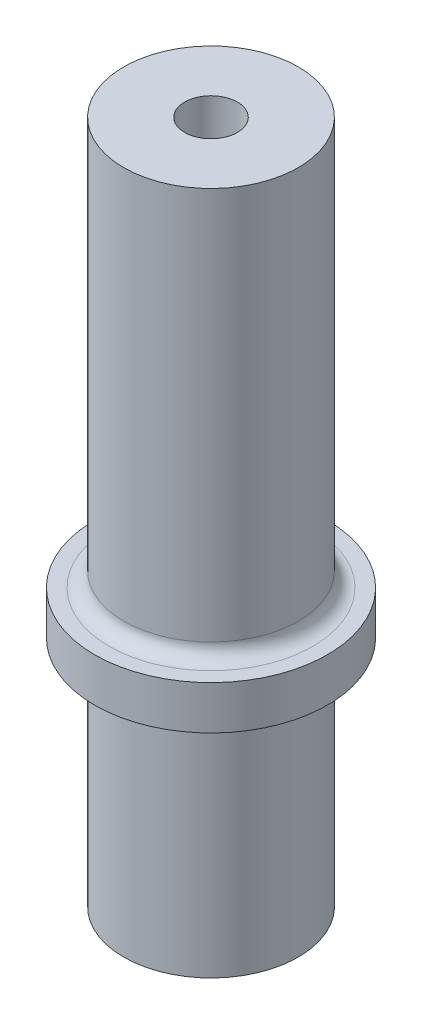
ISO-10303-21;
HEADER;
FILE_DESCRIPTION(('STEP AP214'),'2;1');
FILE_NAME('part.step','',(''),(''),'','','');
FILE_SCHEMA(('AUTOMOTIVE_DESIGN { 1 0 10303 214 1 1 1 1 }'));
ENDSEC;
DATA;
#1=APPLICATION_CONTEXT('core data for automotive mechanical design processes');
#2=APPLICATION_PROTOCOL_DEFINITION('international standard','automotive_design',2000,#1);
#3=PRODUCT_CONTEXT('',#1,'mechanical');
#4=PRODUCT('Part','Part','',(#3));
#5=PRODUCT_RELATED_PRODUCT_CATEGORY('part','',(#4));
#6=PRODUCT_DEFINITION_FORMATION('','',#4);
#7=PRODUCT_DEFINITION_CONTEXT('part definition',#1,'design');
#8=PRODUCT_DEFINITION('design','',#6,#7);
#9=PRODUCT_DEFINITION_SHAPE('','',#8);
#10=(LENGTH_UNIT() NAMED_UNIT(*) SI_UNIT(.MILLI.,.METRE.));
#11=(NAMED_UNIT(*) PLANE_ANGLE_UNIT() SI_UNIT($,.RADIAN.));
#12=(NAMED_UNIT(*) SI_UNIT($,.STERADIAN.) SOLID_ANGLE_UNIT());
#13=UNCERTAINTY_MEASURE_WITH_UNIT(LENGTH_MEASURE(1.E-05),#10,'distance_accuracy_value','');
#14=(GEOMETRIC_REPRESENTATION_CONTEXT(3) GLOBAL_UNCERTAINTY_ASSIGNED_CONTEXT((#13)) GLOBAL_UNIT_ASSIGNED_CONTEXT((#10,
#11,#12)) REPRESENTATION_CONTEXT('',''));
#15=CARTESIAN_POINT('',(0.,0.,0.));
#16=DIRECTION('',(0.,0.,1.));
#17=DIRECTION('',(1.,0.,0.));
#18=AXIS2_PLACEMENT_3D('',#15,#16,#17);
#19=CARTESIAN_POINT('',(0.,-53.766632852948,0.));
#20=DIRECTION('',(0.,-1.,0.));
#21=DIRECTION('',(0.,0.,-1.));
#22=AXIS2_PLACEMENT_3D('',#19,#20,#21);
#23=PLANE('',#22);
#24=CARTESIAN_POINT('',(0.,-53.766632852948,0.));
#25=DIRECTION('',(0.,1.,0.));
#26=DIRECTION('',(0.,0.,1.));
#27=AXIS2_PLACEMENT_3D('',#24,#25,#26);
#28=CIRCLE('',#27,19.05);
#29=CARTESIAN_POINT('',(0.,-53.766632852948,19.05));
#30=VERTEX_POINT('',#29);
#31=EDGE_CURVE('E81',#30,#30,#28,.T.);
#32=ORIENTED_EDGE('',*,*,#31,.F.);
#33=EDGE_LOOP('',(#32));
#34=FACE_BOUND('',#33,.T.);
#35=ADVANCED_FACE('F47',(#34),#23,.T.);
#36=CARTESIAN_POINT('',(0.,95.458367147052,0.));
#37=DIRECTION('',(0.,1.,0.));
#38=DIRECTION('',(0.,0.,1.));
#39=AXIS2_PLACEMENT_3D('',#36,#37,#38);
#40=CYLINDRICAL_SURFACE('',#39,19.05);
#41=CARTESIAN_POINT('',(0.,-6.14163285294796,0.));
#42=DIRECTION('',(0.,-1.,0.));
#43=DIRECTION('',(0.,0.,-1.));
#44=AXIS2_PLACEMENT_3D('',#41,#42,#43);
#45=CIRCLE('',#44,19.05);
#46=CARTESIAN_POINT('',(0.,-6.14163285294796,-19.05));
#47=VERTEX_POINT('',#46);
#48=EDGE_CURVE('E87',#47,#47,#45,.T.);
#49=ORIENTED_EDGE('',*,*,#48,.T.);
#50=EDGE_LOOP('',(#49));
#51=FACE_BOUND('',#50,.T.);
#52=ORIENTED_EDGE('',*,*,#31,.T.);
#53=EDGE_LOOP('',(#52));
#54=FACE_BOUND('',#53,.T.);
#55=ADVANCED_FACE('F104',(#51,#54),#40,.T.);
#56=CARTESIAN_POINT('',(-25.4,-2.96663285294795,0.));
#57=DIRECTION('',(0.,-1.,0.));
#58=DIRECTION('',(0.,0.,-1.));
#59=AXIS2_PLACEMENT_3D('',#56,#57,#58);
#60=PLANE('',#59);
#61=CARTESIAN_POINT('',(0.,-2.96663285294795,0.));
#62=DIRECTION('',(0.,-1.,0.));
#63=DIRECTION('',(0.,0.,-1.));
#64=AXIS2_PLACEMENT_3D('',#61,#62,#63);
#65=CIRCLE('',#64,22.225);
#66=CARTESIAN_POINT('',(0.,-2.96663285294795,-22.225));
#67=VERTEX_POINT('',#66);
#68=EDGE_CURVE('E84',#67,#67,#65,.F.);
#69=ORIENTED_EDGE('',*,*,#68,.T.);
#70=EDGE_LOOP('',(#69));
#71=FACE_BOUND('',#70,.T.);
#72=CARTESIAN_POINT('',(0.,-2.96663285294796,0.));
#73=DIRECTION('',(0.,1.,0.));
#74=DIRECTION('',(0.,0.,1.));
#75=AXIS2_PLACEMENT_3D('',#72,#73,#74);
#76=CIRCLE('',#75,25.4);
#77=CARTESIAN_POINT('',(0.,-2.96663285294796,25.4));
#78=VERTEX_POINT('',#77);
#79=EDGE_CURVE('E78',#78,#78,#76,.T.);
#80=ORIENTED_EDGE('',*,*,#79,.F.);
#81=EDGE_LOOP('',(#80));
#82=FACE_BOUND('',#81,.T.);
#83=ADVANCED_FACE('F110',(#71,#82),#60,.T.);
#84=CARTESIAN_POINT('',(0.,95.458367147052,0.));
#85=DIRECTION('',(0.,1.,0.));
#86=DIRECTION('',(0.,0.,1.));
#87=AXIS2_PLACEMENT_3D('',#84,#85,#86);
#88=CYLINDRICAL_SURFACE('',#87,25.4);
#89=ORIENTED_EDGE('',*,*,#79,.T.);
#90=EDGE_LOOP('',(#89));
#91=FACE_BOUND('',#90,.T.);
#92=CARTESIAN_POINT('',(0.,6.55836714705205,0.));
#93=DIRECTION('',(0.,1.,0.));
#94=DIRECTION('',(0.,0.,1.));
#95=AXIS2_PLACEMENT_3D('',#92,#93,#94);
#96=CIRCLE('',#95,25.4);
#97=CARTESIAN_POINT('',(0.,6.55836714705205,25.4));
#98=VERTEX_POINT('',#97);
#99=EDGE_CURVE('E71',#98,#98,#96,.T.);
#100=ORIENTED_EDGE('',*,*,#99,.F.);
#101=EDGE_LOOP('',(#100));
#102=FACE_BOUND('',#101,.T.);
#103=ADVANCED_FACE('F117',(#91,#102),#88,.T.);
#104=CARTESIAN_POINT('',(-25.4,6.55836714705205,0.));
#105=DIRECTION('',(0.,1.,0.));
#106=DIRECTION('',(0.,0.,1.));
#107=AXIS2_PLACEMENT_3D('',#104,#105,#106);
#108=PLANE('',#107);
#109=CARTESIAN_POINT('',(0.,6.55836714705205,0.));
#110=DIRECTION('',(0.,1.,0.));
#111=DIRECTION('',(0.,0.,1.));
#112=AXIS2_PLACEMENT_3D('',#109,#110,#111);
#113=CIRCLE('',#112,22.225);
#114=CARTESIAN_POINT('',(0.,6.55836714705205,22.225));
#115=VERTEX_POINT('',#114);
#116=EDGE_CURVE('E11',#115,#115,#113,.F.);
#117=ORIENTED_EDGE('',*,*,#116,.T.);
#118=EDGE_LOOP('',(#117));
#119=FACE_BOUND('',#118,.T.);
#120=ORIENTED_EDGE('',*,*,#99,.T.);
#121=EDGE_LOOP('',(#120));
#122=FACE_BOUND('',#121,.T.);
#123=ADVANCED_FACE('F121',(#119,#122),#108,.T.);
#124=CARTESIAN_POINT('',(0.,95.458367147052,0.));
#125=DIRECTION('',(0.,1.,0.));
#126=DIRECTION('',(0.,0.,1.));
#127=AXIS2_PLACEMENT_3D('',#124,#125,#126);
#128=CYLINDRICAL_SURFACE('',#127,19.05);
#129=CARTESIAN_POINT('',(0.,9.73336714705204,0.));
#130=DIRECTION('',(0.,1.,0.));
#131=DIRECTION('',(0.,0.,1.));
#132=AXIS2_PLACEMENT_3D('',#129,#130,#131);
#133=CIRCLE('',#132,19.05);
#134=CARTESIAN_POINT('',(0.,9.73336714705204,19.05));
#135=VERTEX_POINT('',#134);
#136=EDGE_CURVE('E54',#135,#135,#133,.T.);
#137=ORIENTED_EDGE('',*,*,#136,.T.);
#138=EDGE_LOOP('',(#137));
#139=FACE_BOUND('',#138,.T.);
#140=CARTESIAN_POINT('',(0.,95.458367147052,0.));
#141=DIRECTION('',(0.,1.,0.));
#142=DIRECTION('',(0.,0.,1.));
#143=AXIS2_PLACEMENT_3D('',#140,#141,#142);
#144=CIRCLE('',#143,19.05);
#145=CARTESIAN_POINT('',(0.,95.458367147052,19.05));
#146=VERTEX_POINT('',#145);
#147=EDGE_CURVE('E67',#146,#146,#144,.T.);
#148=ORIENTED_EDGE('',*,*,#147,.F.);
#149=EDGE_LOOP('',(#148));
#150=FACE_BOUND('',#149,.T.);
#151=ADVANCED_FACE('F92',(#139,#150),#128,.T.);
#152=CARTESIAN_POINT('',(-19.05,95.458367147052,0.));
#153=DIRECTION('',(0.,1.,0.));
#154=DIRECTION('',(0.,0.,1.));
#155=AXIS2_PLACEMENT_3D('',#152,#153,#154);
#156=PLANE('',#155);
#157=CARTESIAN_POINT('',(0.,95.458367147052,0.));
#158=DIRECTION('',(0.,1.,0.));
#159=DIRECTION('',(0.,0.,1.));
#160=AXIS2_PLACEMENT_3D('',#157,#158,#159);
#161=CIRCLE('',#160,5.75437);
#162=CARTESIAN_POINT('',(0.,95.458367147052,5.75437));
#163=VERTEX_POINT('',#162);
#164=EDGE_CURVE('E68',#163,#163,#161,.T.);
#165=ORIENTED_EDGE('',*,*,#164,.F.);
#166=EDGE_LOOP('',(#165));
#167=FACE_BOUND('',#166,.T.);
#168=ORIENTED_EDGE('',*,*,#147,.T.);
#169=EDGE_LOOP('',(#168));
#170=FACE_BOUND('',#169,.T.);
#171=ADVANCED_FACE('F61',(#167,#170),#156,.T.);
#172=CARTESIAN_POINT('',(0.,66.248367147052,0.));
#173=DIRECTION('',(0.,1.,0.));
#174=DIRECTION('',(0.,0.,1.));
#175=AXIS2_PLACEMENT_3D('',#172,#173,#174);
#176=CONICAL_SURFACE('',#175,5.75436999999999,1.02974425867665);
#177=CARTESIAN_POINT('',(0.,62.7907928267384,0.));
#178=VERTEX_POINT('',#177);
#179=VERTEX_LOOP('',#178);
#180=FACE_BOUND('',#179,.T.);
#181=CARTESIAN_POINT('',(0.,66.248367147052,0.));
#182=DIRECTION('',(0.,1.,0.));
#183=DIRECTION('',(0.,0.,1.));
#184=AXIS2_PLACEMENT_3D('',#181,#182,#183);
#185=CIRCLE('',#184,5.75436999999999);
#186=CARTESIAN_POINT('',(0.,66.248367147052,5.75436999999999));
#187=VERTEX_POINT('',#186);
#188=EDGE_CURVE('E65',#187,#187,#185,.T.);
#189=ORIENTED_EDGE('',*,*,#188,.T.);
#190=EDGE_LOOP('',(#189));
#191=FACE_BOUND('',#190,.T.);
#192=ADVANCED_FACE('F57',(#180,#191),#176,.F.);
#193=CARTESIAN_POINT('',(0.,95.458367147052,0.));
#194=DIRECTION('',(0.,1.,0.));
#195=DIRECTION('',(0.,0.,1.));
#196=AXIS2_PLACEMENT_3D('',#193,#194,#195);
#197=CYLINDRICAL_SURFACE('',#196,5.75437);
#198=ORIENTED_EDGE('',*,*,#188,.F.);
#199=EDGE_LOOP('',(#198));
#200=FACE_BOUND('',#199,.T.);
#201=ORIENTED_EDGE('',*,*,#164,.T.);
#202=EDGE_LOOP('',(#201));
#203=FACE_BOUND('',#202,.T.);
#204=ADVANCED_FACE('F60',(#200,#203),#197,.F.);
#205=CARTESIAN_POINT('',(0.,-6.14163285294796,0.));
#206=DIRECTION('',(0.,-1.,0.));
#207=DIRECTION('',(0.,0.,-1.));
#208=AXIS2_PLACEMENT_3D('',#205,#206,#207);
#209=TOROIDAL_SURFACE('',#208,22.225,3.175);
#210=ORIENTED_EDGE('',*,*,#48,.F.);
#211=EDGE_LOOP('',(#210));
#212=FACE_BOUND('',#211,.T.);
#213=ORIENTED_EDGE('',*,*,#68,.F.);
#214=EDGE_LOOP('',(#213));
#215=FACE_BOUND('',#214,.T.);
#216=ADVANCED_FACE('F96',(#212,#215),#209,.F.);
#217=CARTESIAN_POINT('',(0.,9.73336714705204,0.));
#218=DIRECTION('',(0.,1.,0.));
#219=DIRECTION('',(0.,0.,1.));
#220=AXIS2_PLACEMENT_3D('',#217,#218,#219);
#221=TOROIDAL_SURFACE('',#220,22.225,3.175);
#222=ORIENTED_EDGE('',*,*,#116,.F.);
#223=EDGE_LOOP('',(#222));
#224=FACE_BOUND('',#223,.T.);
#225=ORIENTED_EDGE('',*,*,#136,.F.);
#226=EDGE_LOOP('',(#225));
#227=FACE_BOUND('',#226,.T.);
#228=ADVANCED_FACE('F49',(#224,#227),#221,.F.);
#229=CLOSED_SHELL('',(#35,#55,#83,#103,#123,#151,#171,#192,#204,#216,#228));
#230=MANIFOLD_SOLID_BREP('B2',#229);
#231=ADVANCED_BREP_SHAPE_REPRESENTATION('',(#18,#230),#14);
#232=SHAPE_DEFINITION_REPRESENTATION(#9,#231);
ENDSEC;
END-ISO-10303-21;
